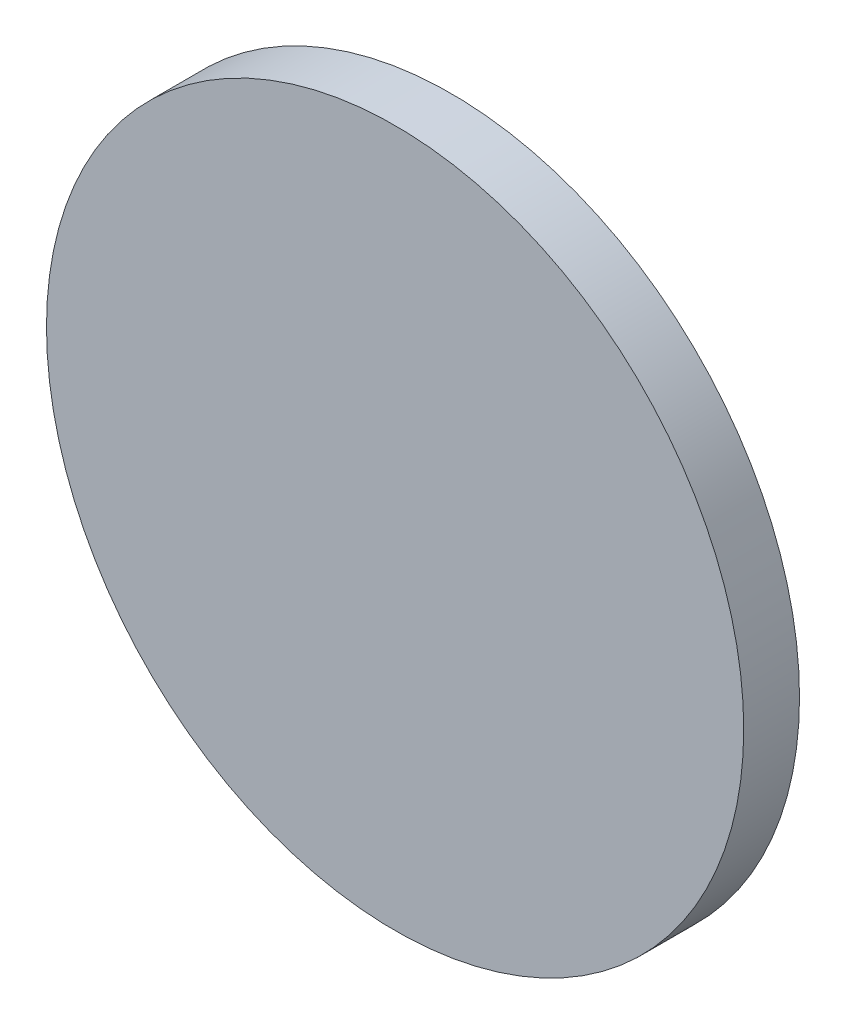
ISO-10303-21;
HEADER;
FILE_DESCRIPTION(('STEP AP214'),'2;1');
FILE_NAME('part.step','',(''),(''),'','','');
FILE_SCHEMA(('AUTOMOTIVE_DESIGN { 1 0 10303 214 1 1 1 1 }'));
ENDSEC;
DATA;
#1=APPLICATION_CONTEXT('core data for automotive mechanical design processes');
#2=APPLICATION_PROTOCOL_DEFINITION('international standard','automotive_design',2000,#1);
#3=PRODUCT_CONTEXT('',#1,'mechanical');
#4=PRODUCT('Part','Part','',(#3));
#5=PRODUCT_RELATED_PRODUCT_CATEGORY('part','',(#4));
#6=PRODUCT_DEFINITION_FORMATION('','',#4);
#7=PRODUCT_DEFINITION_CONTEXT('part definition',#1,'design');
#8=PRODUCT_DEFINITION('design','',#6,#7);
#9=PRODUCT_DEFINITION_SHAPE('','',#8);
#10=(LENGTH_UNIT() NAMED_UNIT(*) SI_UNIT(.MILLI.,.METRE.));
#11=(NAMED_UNIT(*) PLANE_ANGLE_UNIT() SI_UNIT($,.RADIAN.));
#12=(NAMED_UNIT(*) SI_UNIT($,.STERADIAN.) SOLID_ANGLE_UNIT());
#13=UNCERTAINTY_MEASURE_WITH_UNIT(LENGTH_MEASURE(1.E-05),#10,'distance_accuracy_value','');
#14=(GEOMETRIC_REPRESENTATION_CONTEXT(3) GLOBAL_UNCERTAINTY_ASSIGNED_CONTEXT((#13)) GLOBAL_UNIT_ASSIGNED_CONTEXT((#10,
#11,#12)) REPRESENTATION_CONTEXT('',''));
#15=CARTESIAN_POINT('',(0.,0.,0.));
#16=DIRECTION('',(0.,0.,1.));
#17=DIRECTION('',(1.,0.,0.));
#18=AXIS2_PLACEMENT_3D('',#15,#16,#17);
#19=CARTESIAN_POINT('',(0.,0.,4.));
#20=DIRECTION('',(0.,0.,-1.));
#21=DIRECTION('',(-1.,0.,0.));
#22=AXIS2_PLACEMENT_3D('',#19,#20,#21);
#23=CYLINDRICAL_SURFACE('',#22,25.);
#24=CARTESIAN_POINT('',(0.,0.,4.));
#25=DIRECTION('',(0.,0.,1.));
#26=DIRECTION('',(1.,0.,0.));
#27=AXIS2_PLACEMENT_3D('',#24,#25,#26);
#28=CIRCLE('',#27,25.);
#29=CARTESIAN_POINT('',(25.,0.,4.));
#30=VERTEX_POINT('',#29);
#31=EDGE_CURVE('E10',#30,#30,#28,.T.);
#32=ORIENTED_EDGE('',*,*,#31,.F.);
#33=EDGE_LOOP('',(#32));
#34=FACE_BOUND('',#33,.T.);
#35=CARTESIAN_POINT('',(0.,0.,0.));
#36=DIRECTION('',(0.,0.,1.));
#37=DIRECTION('',(1.,0.,0.));
#38=AXIS2_PLACEMENT_3D('',#35,#36,#37);
#39=CIRCLE('',#38,25.);
#40=CARTESIAN_POINT('',(25.,0.,0.));
#41=VERTEX_POINT('',#40);
#42=EDGE_CURVE('E38',#41,#41,#39,.T.);
#43=ORIENTED_EDGE('',*,*,#42,.T.);
#44=EDGE_LOOP('',(#43));
#45=FACE_BOUND('',#44,.T.);
#46=ADVANCED_FACE('F35',(#34,#45),#23,.T.);
#47=CARTESIAN_POINT('',(0.,0.,4.));
#48=DIRECTION('',(0.,0.,1.));
#49=DIRECTION('',(1.,0.,0.));
#50=AXIS2_PLACEMENT_3D('',#47,#48,#49);
#51=PLANE('',#50);
#52=ORIENTED_EDGE('',*,*,#31,.T.);
#53=EDGE_LOOP('',(#52));
#54=FACE_BOUND('',#53,.T.);
#55=ADVANCED_FACE('F50',(#54),#51,.T.);
#56=CARTESIAN_POINT('',(0.,0.,0.));
#57=DIRECTION('',(0.,0.,1.));
#58=DIRECTION('',(1.,0.,0.));
#59=AXIS2_PLACEMENT_3D('',#56,#57,#58);
#60=PLANE('',#59);
#61=ORIENTED_EDGE('',*,*,#42,.F.);
#62=EDGE_LOOP('',(#61));
#63=FACE_BOUND('',#62,.T.);
#64=ADVANCED_FACE('F48',(#63),#60,.F.);
#65=CLOSED_SHELL('',(#46,#55,#64));
#66=MANIFOLD_SOLID_BREP('B2',#65);
#67=ADVANCED_BREP_SHAPE_REPRESENTATION('',(#18,#66),#14);
#68=SHAPE_DEFINITION_REPRESENTATION(#9,#67);
ENDSEC;
END-ISO-10303-21;
